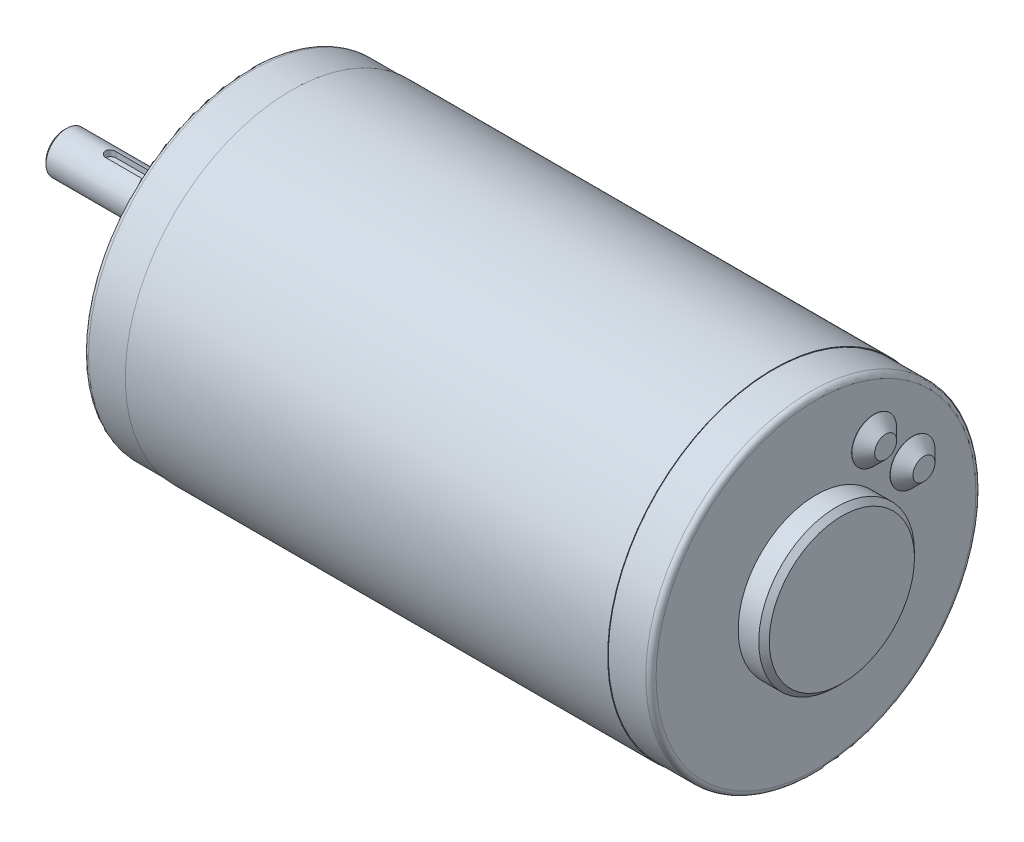
ISO-10303-21;
HEADER;
FILE_DESCRIPTION(('STEP AP214'),'2;1');
FILE_NAME('part.step','',(''),(''),'','','');
FILE_SCHEMA(('AUTOMOTIVE_DESIGN { 1 0 10303 214 1 1 1 1 }'));
ENDSEC;
DATA;
#1=APPLICATION_CONTEXT('core data for automotive mechanical design processes');
#2=APPLICATION_PROTOCOL_DEFINITION('international standard','automotive_design',2000,#1);
#3=PRODUCT_CONTEXT('',#1,'mechanical');
#4=PRODUCT('Part','Part','',(#3));
#5=PRODUCT_RELATED_PRODUCT_CATEGORY('part','',(#4));
#6=PRODUCT_DEFINITION_FORMATION('','',#4);
#7=PRODUCT_DEFINITION_CONTEXT('part definition',#1,'design');
#8=PRODUCT_DEFINITION('design','',#6,#7);
#9=PRODUCT_DEFINITION_SHAPE('','',#8);
#10=(LENGTH_UNIT() NAMED_UNIT(*) SI_UNIT(.MILLI.,.METRE.));
#11=(NAMED_UNIT(*) PLANE_ANGLE_UNIT() SI_UNIT($,.RADIAN.));
#12=(NAMED_UNIT(*) SI_UNIT($,.STERADIAN.) SOLID_ANGLE_UNIT());
#13=UNCERTAINTY_MEASURE_WITH_UNIT(LENGTH_MEASURE(1.E-05),#10,'distance_accuracy_value','');
#14=(GEOMETRIC_REPRESENTATION_CONTEXT(3) GLOBAL_UNCERTAINTY_ASSIGNED_CONTEXT((#13)) GLOBAL_UNIT_ASSIGNED_CONTEXT((#10,
#11,#12)) REPRESENTATION_CONTEXT('',''));
#15=CARTESIAN_POINT('',(0.,0.,0.));
#16=DIRECTION('',(0.,0.,1.));
#17=DIRECTION('',(1.,0.,0.));
#18=AXIS2_PLACEMENT_3D('',#15,#16,#17);
#19=CARTESIAN_POINT('',(8.2296,31.877,0.));
#20=DIRECTION('',(-1.,0.,0.));
#21=DIRECTION('',(0.,0.,1.));
#22=AXIS2_PLACEMENT_3D('',#19,#20,#21);
#23=PLANE('',#22);
#24=CARTESIAN_POINT('',(8.2296,0.,0.));
#25=DIRECTION('',(1.,0.,0.));
#26=DIRECTION('',(0.,0.,-1.));
#27=AXIS2_PLACEMENT_3D('',#24,#25,#26);
#28=CIRCLE('',#27,32.004);
#29=CARTESIAN_POINT('',(8.2296,0.,-32.004));
#30=VERTEX_POINT('',#29);
#31=EDGE_CURVE('E545',#30,#30,#28,.T.);
#32=ORIENTED_EDGE('',*,*,#31,.F.);
#33=EDGE_LOOP('',(#32));
#34=FACE_BOUND('',#33,.T.);
#35=CARTESIAN_POINT('',(8.2296,0.,0.));
#36=DIRECTION('',(-1.,0.,0.));
#37=DIRECTION('',(0.,0.,1.));
#38=AXIS2_PLACEMENT_3D('',#35,#36,#37);
#39=CIRCLE('',#38,31.877);
#40=CARTESIAN_POINT('',(8.2296,0.,31.877));
#41=VERTEX_POINT('',#40);
#42=EDGE_CURVE('E123',#41,#41,#39,.T.);
#43=ORIENTED_EDGE('',*,*,#42,.F.);
#44=EDGE_LOOP('',(#43));
#45=FACE_BOUND('',#44,.T.);
#46=ADVANCED_FACE('F49',(#34,#45),#23,.T.);
#47=CARTESIAN_POINT('',(111.8479,18.6070906828553,-11.2073596390943));
#48=DIRECTION('',(1.,0.,0.));
#49=DIRECTION('',(0.,0.,-1.));
#50=AXIS2_PLACEMENT_3D('',#47,#48,#49);
#51=PLANE('',#50);
#52=CARTESIAN_POINT('',(111.84789999993,18.6070906828553,-11.2073596390943));
#53=DIRECTION('',(-1.,0.,0.));
#54=DIRECTION('',(0.,-1.,0.));
#55=AXIS2_PLACEMENT_3D('',#52,#53,#54);
#56=CIRCLE('',#55,2.11800000003146);
#57=CARTESIAN_POINT('',(111.84789999993,16.4890906828238,-11.2073596390943));
#58=VERTEX_POINT('',#57);
#59=EDGE_CURVE('E677',#58,#58,#56,.T.);
#60=ORIENTED_EDGE('',*,*,#59,.F.);
#61=EDGE_LOOP('',(#60));
#62=FACE_BOUND('',#61,.T.);
#63=ADVANCED_FACE('F182',(#62),#51,.T.);
#64=CARTESIAN_POINT('',(114.6,15.0368,0.));
#65=DIRECTION('',(1.,0.,0.));
#66=DIRECTION('',(0.,0.,-1.));
#67=AXIS2_PLACEMENT_3D('',#64,#65,#66);
#68=PLANE('',#67);
#69=CARTESIAN_POINT('',(114.6,0.,0.));
#70=DIRECTION('',(-1.,0.,0.));
#71=DIRECTION('',(0.,-1.,0.));
#72=AXIS2_PLACEMENT_3D('',#69,#70,#71);
#73=CIRCLE('',#72,14.0208);
#74=CARTESIAN_POINT('',(114.6,-14.0208,0.));
#75=VERTEX_POINT('',#74);
#76=EDGE_CURVE('E667',#75,#75,#73,.T.);
#77=ORIENTED_EDGE('',*,*,#76,.F.);
#78=EDGE_LOOP('',(#77));
#79=FACE_BOUND('',#78,.T.);
#80=ADVANCED_FACE('F190',(#79),#68,.T.);
#81=CARTESIAN_POINT('',(111.8479,11.2073596390943,-18.6070906828553));
#82=DIRECTION('',(1.,0.,0.));
#83=DIRECTION('',(0.,0.,-1.));
#84=AXIS2_PLACEMENT_3D('',#81,#82,#83);
#85=PLANE('',#84);
#86=CARTESIAN_POINT('',(111.84789999993,11.2073596390943,-18.6070906828553));
#87=DIRECTION('',(-1.,0.,0.));
#88=DIRECTION('',(0.,0.,1.));
#89=AXIS2_PLACEMENT_3D('',#86,#87,#88);
#90=CIRCLE('',#89,2.1180000000021);
#91=CARTESIAN_POINT('',(111.84789999993,11.2073596390943,-16.4890906828532));
#92=VERTEX_POINT('',#91);
#93=EDGE_CURVE('E657',#92,#92,#90,.T.);
#94=ORIENTED_EDGE('',*,*,#93,.F.);
#95=EDGE_LOOP('',(#94));
#96=FACE_BOUND('',#95,.T.);
#97=ADVANCED_FACE('F323',(#96),#85,.T.);
#98=CARTESIAN_POINT('',(109.647900000027,18.6070906828553,-11.2073596390943));
#99=DIRECTION('',(-1.,0.,0.));
#100=DIRECTION('',(0.,-1.,0.));
#101=AXIS2_PLACEMENT_3D('',#98,#99,#100);
#102=CONICAL_SURFACE('',#101,4.31799999987712,0.785398163384529);
#103=CARTESIAN_POINT('',(109.6479,18.6070906828553,-11.2073596390943));
#104=DIRECTION('',(-1.,0.,0.));
#105=DIRECTION('',(0.,0.,1.));
#106=AXIS2_PLACEMENT_3D('',#103,#104,#105);
#107=CIRCLE('',#106,4.318);
#108=CARTESIAN_POINT('',(109.6479,18.6070906828553,-6.88935963909434));
#109=VERTEX_POINT('',#108);
#110=EDGE_CURVE('E637',#109,#109,#107,.T.);
#111=ORIENTED_EDGE('',*,*,#110,.F.);
#112=EDGE_LOOP('',(#111));
#113=FACE_BOUND('',#112,.T.);
#114=ORIENTED_EDGE('',*,*,#59,.T.);
#115=EDGE_LOOP('',(#114));
#116=FACE_BOUND('',#115,.T.);
#117=ADVANCED_FACE('F314',(#113,#116),#102,.T.);
#118=CARTESIAN_POINT('',(113.584,0.,0.));
#119=DIRECTION('',(-1.,0.,0.));
#120=DIRECTION('',(0.,-1.,0.));
#121=AXIS2_PLACEMENT_3D('',#118,#119,#120);
#122=CONICAL_SURFACE('',#121,15.0368,0.785398163397441);
#123=ORIENTED_EDGE('',*,*,#76,.T.);
#124=EDGE_LOOP('',(#123));
#125=FACE_BOUND('',#124,.T.);
#126=CARTESIAN_POINT('',(113.584,0.,0.));
#127=DIRECTION('',(1.,0.,0.));
#128=DIRECTION('',(0.,0.,-1.));
#129=AXIS2_PLACEMENT_3D('',#126,#127,#128);
#130=CIRCLE('',#129,15.0368);
#131=CARTESIAN_POINT('',(113.584,0.,-15.0368));
#132=VERTEX_POINT('',#131);
#133=EDGE_CURVE('E628',#132,#132,#130,.F.);
#134=ORIENTED_EDGE('',*,*,#133,.F.);
#135=EDGE_LOOP('',(#134));
#136=FACE_BOUND('',#135,.T.);
#137=ADVANCED_FACE('F305',(#125,#136),#122,.T.);
#138=CARTESIAN_POINT('',(109.647900000084,11.2073596390943,-18.6070906828553));
#139=DIRECTION('',(-1.,0.,0.));
#140=DIRECTION('',(0.,0.,1.));
#141=AXIS2_PLACEMENT_3D('',#138,#139,#140);
#142=CONICAL_SURFACE('',#141,4.31799999990461,0.785398163410367);
#143=CARTESIAN_POINT('',(109.6479,11.2073596390943,-18.6070906828553));
#144=DIRECTION('',(-1.,0.,0.));
#145=DIRECTION('',(0.,0.,1.));
#146=AXIS2_PLACEMENT_3D('',#143,#144,#145);
#147=CIRCLE('',#146,4.318);
#148=CARTESIAN_POINT('',(109.6479,11.2073596390943,-14.2890906828553));
#149=VERTEX_POINT('',#148);
#150=EDGE_CURVE('E618',#149,#149,#147,.T.);
#151=ORIENTED_EDGE('',*,*,#150,.F.);
#152=EDGE_LOOP('',(#151));
#153=FACE_BOUND('',#152,.T.);
#154=ORIENTED_EDGE('',*,*,#93,.T.);
#155=EDGE_LOOP('',(#154));
#156=FACE_BOUND('',#155,.T.);
#157=ADVANCED_FACE('F297',(#153,#156),#142,.T.);
#158=CARTESIAN_POINT('',(111.8479,18.6070906828553,-11.2073596390943));
#159=DIRECTION('',(-1.,0.,0.));
#160=DIRECTION('',(0.,0.,1.));
#161=AXIS2_PLACEMENT_3D('',#158,#159,#160);
#162=CYLINDRICAL_SURFACE('',#161,4.318);
#163=CARTESIAN_POINT('',(109.6,18.6070906828553,-11.2073596390943));
#164=DIRECTION('',(-1.,0.,0.));
#165=DIRECTION('',(0.,0.,1.));
#166=AXIS2_PLACEMENT_3D('',#163,#164,#165);
#167=CIRCLE('',#166,4.318);
#168=CARTESIAN_POINT('',(109.6,18.6070906828553,-6.88935963909434));
#169=VERTEX_POINT('',#168);
#170=EDGE_CURVE('E608',#169,#169,#167,.T.);
#171=ORIENTED_EDGE('',*,*,#170,.F.);
#172=EDGE_LOOP('',(#171));
#173=FACE_BOUND('',#172,.T.);
#174=ORIENTED_EDGE('',*,*,#110,.T.);
#175=EDGE_LOOP('',(#174));
#176=FACE_BOUND('',#175,.T.);
#177=ADVANCED_FACE('F289',(#173,#176),#162,.T.);
#178=CARTESIAN_POINT('',(0.,0.,0.));
#179=DIRECTION('',(1.,0.,0.));
#180=DIRECTION('',(0.,0.,-1.));
#181=AXIS2_PLACEMENT_3D('',#178,#179,#180);
#182=CYLINDRICAL_SURFACE('',#181,15.0368);
#183=CARTESIAN_POINT('',(109.6,0.,0.));
#184=DIRECTION('',(1.,0.,0.));
#185=DIRECTION('',(0.,0.,-1.));
#186=AXIS2_PLACEMENT_3D('',#183,#184,#185);
#187=CIRCLE('',#186,15.0368);
#188=CARTESIAN_POINT('',(109.6,0.,-15.0368));
#189=VERTEX_POINT('',#188);
#190=EDGE_CURVE('E598',#189,#189,#187,.F.);
#191=ORIENTED_EDGE('',*,*,#190,.F.);
#192=EDGE_LOOP('',(#191));
#193=FACE_BOUND('',#192,.T.);
#194=ORIENTED_EDGE('',*,*,#133,.T.);
#195=EDGE_LOOP('',(#194));
#196=FACE_BOUND('',#195,.T.);
#197=ADVANCED_FACE('F281',(#193,#196),#182,.T.);
#198=CARTESIAN_POINT('',(111.8479,11.2073596390943,-18.6070906828553));
#199=DIRECTION('',(-1.,0.,0.));
#200=DIRECTION('',(0.,0.,1.));
#201=AXIS2_PLACEMENT_3D('',#198,#199,#200);
#202=CYLINDRICAL_SURFACE('',#201,4.318);
#203=CARTESIAN_POINT('',(109.6,11.2073596390943,-18.6070906828553));
#204=DIRECTION('',(-1.,0.,0.));
#205=DIRECTION('',(0.,0.,1.));
#206=AXIS2_PLACEMENT_3D('',#203,#204,#205);
#207=CIRCLE('',#206,4.318);
#208=CARTESIAN_POINT('',(109.6,11.2073596390943,-14.2890906828553));
#209=VERTEX_POINT('',#208);
#210=EDGE_CURVE('E589',#209,#209,#207,.T.);
#211=ORIENTED_EDGE('',*,*,#210,.F.);
#212=EDGE_LOOP('',(#211));
#213=FACE_BOUND('',#212,.T.);
#214=ORIENTED_EDGE('',*,*,#150,.T.);
#215=EDGE_LOOP('',(#214));
#216=FACE_BOUND('',#215,.T.);
#217=ADVANCED_FACE('F272',(#213,#216),#202,.T.);
#218=CARTESIAN_POINT('',(109.6,31.877,0.));
#219=DIRECTION('',(1.,0.,0.));
#220=DIRECTION('',(0.,0.,-1.));
#221=AXIS2_PLACEMENT_3D('',#218,#219,#220);
#222=PLANE('',#221);
#223=ORIENTED_EDGE('',*,*,#210,.T.);
#224=EDGE_LOOP('',(#223));
#225=FACE_BOUND('',#224,.T.);
#226=ORIENTED_EDGE('',*,*,#190,.T.);
#227=EDGE_LOOP('',(#226));
#228=FACE_BOUND('',#227,.T.);
#229=CARTESIAN_POINT('',(109.6,0.,0.));
#230=DIRECTION('',(-1.,0.,0.));
#231=DIRECTION('',(0.,0.,1.));
#232=AXIS2_PLACEMENT_3D('',#229,#230,#231);
#233=CIRCLE('',#232,30.877);
#234=CARTESIAN_POINT('',(109.6,0.,30.877));
#235=VERTEX_POINT('',#234);
#236=CARTESIAN_POINT('',(109.6,0.,-30.877));
#237=VERTEX_POINT('',#236);
#238=EDGE_CURVE('E65',#235,#237,#233,.T.);
#239=ORIENTED_EDGE('',*,*,#238,.F.);
#240=CARTESIAN_POINT('',(109.6,0.,0.));
#241=DIRECTION('',(-1.,0.,0.));
#242=DIRECTION('',(0.,0.,-1.));
#243=AXIS2_PLACEMENT_3D('',#240,#241,#242);
#244=CIRCLE('',#243,30.877);
#245=EDGE_CURVE('E574',#237,#235,#244,.T.);
#246=ORIENTED_EDGE('',*,*,#245,.F.);
#247=EDGE_LOOP('',(#239,#246));
#248=FACE_BOUND('',#247,.T.);
#249=ORIENTED_EDGE('',*,*,#170,.T.);
#250=EDGE_LOOP('',(#249));
#251=FACE_BOUND('',#250,.T.);
#252=ADVANCED_FACE('F138',(#225,#228,#248,#251),#222,.T.);
#253=CARTESIAN_POINT('',(108.6,0.,0.));
#254=DIRECTION('',(1.,0.,0.));
#255=DIRECTION('',(0.,0.,-1.));
#256=AXIS2_PLACEMENT_3D('',#253,#254,#255);
#257=TOROIDAL_SURFACE('',#256,30.877,1.);
#258=CARTESIAN_POINT('',(108.6,0.,0.));
#259=DIRECTION('',(1.,0.,0.));
#260=DIRECTION('',(0.,0.,-1.));
#261=AXIS2_PLACEMENT_3D('',#258,#259,#260);
#262=CIRCLE('',#261,31.877);
#263=CARTESIAN_POINT('',(108.6,0.,-31.877));
#264=VERTEX_POINT('',#263);
#265=EDGE_CURVE('E129',#264,#264,#262,.F.);
#266=ORIENTED_EDGE('',*,*,#265,.F.);
#267=EDGE_LOOP('',(#266));
#268=FACE_BOUND('',#267,.T.);
#269=ORIENTED_EDGE('',*,*,#245,.T.);
#270=ORIENTED_EDGE('',*,*,#238,.T.);
#271=EDGE_LOOP('',(#269,#270));
#272=FACE_BOUND('',#271,.T.);
#273=ADVANCED_FACE('F132',(#268,#272),#257,.T.);
#274=CARTESIAN_POINT('',(0.,0.,0.));
#275=DIRECTION('',(1.,0.,0.));
#276=DIRECTION('',(0.,0.,-1.));
#277=AXIS2_PLACEMENT_3D('',#274,#275,#276);
#278=CYLINDRICAL_SURFACE('',#277,31.877);
#279=CARTESIAN_POINT('',(101.3704,0.,0.));
#280=DIRECTION('',(1.,0.,0.));
#281=DIRECTION('',(0.,0.,-1.));
#282=AXIS2_PLACEMENT_3D('',#279,#280,#281);
#283=CIRCLE('',#282,31.877);
#284=CARTESIAN_POINT('',(101.3704,0.,-31.877));
#285=VERTEX_POINT('',#284);
#286=EDGE_CURVE('E555',#285,#285,#283,.F.);
#287=ORIENTED_EDGE('',*,*,#286,.F.);
#288=EDGE_LOOP('',(#287));
#289=FACE_BOUND('',#288,.T.);
#290=ORIENTED_EDGE('',*,*,#265,.T.);
#291=EDGE_LOOP('',(#290));
#292=FACE_BOUND('',#291,.T.);
#293=ADVANCED_FACE('F137',(#289,#292),#278,.T.);
#294=CARTESIAN_POINT('',(101.3704,32.004,0.));
#295=DIRECTION('',(1.,0.,0.));
#296=DIRECTION('',(0.,0.,-1.));
#297=AXIS2_PLACEMENT_3D('',#294,#295,#296);
#298=PLANE('',#297);
#299=ORIENTED_EDGE('',*,*,#286,.T.);
#300=EDGE_LOOP('',(#299));
#301=FACE_BOUND('',#300,.T.);
#302=CARTESIAN_POINT('',(101.3704,0.,0.));
#303=DIRECTION('',(1.,0.,0.));
#304=DIRECTION('',(0.,0.,-1.));
#305=AXIS2_PLACEMENT_3D('',#302,#303,#304);
#306=CIRCLE('',#305,32.004);
#307=CARTESIAN_POINT('',(101.3704,0.,-32.004));
#308=VERTEX_POINT('',#307);
#309=EDGE_CURVE('E161',#308,#308,#306,.F.);
#310=ORIENTED_EDGE('',*,*,#309,.F.);
#311=EDGE_LOOP('',(#310));
#312=FACE_BOUND('',#311,.T.);
#313=ADVANCED_FACE('F197',(#301,#312),#298,.T.);
#314=CARTESIAN_POINT('',(0.,0.,0.));
#315=DIRECTION('',(1.,0.,0.));
#316=DIRECTION('',(0.,0.,-1.));
#317=AXIS2_PLACEMENT_3D('',#314,#315,#316);
#318=CYLINDRICAL_SURFACE('',#317,32.004);
#319=ORIENTED_EDGE('',*,*,#309,.T.);
#320=EDGE_LOOP('',(#319));
#321=FACE_BOUND('',#320,.T.);
#322=ORIENTED_EDGE('',*,*,#31,.T.);
#323=EDGE_LOOP('',(#322));
#324=FACE_BOUND('',#323,.T.);
#325=ADVANCED_FACE('F184',(#321,#324),#318,.T.);
#326=CARTESIAN_POINT('',(0.,0.,0.));
#327=DIRECTION('',(-1.,0.,0.));
#328=DIRECTION('',(0.,0.,1.));
#329=AXIS2_PLACEMENT_3D('',#326,#327,#328);
#330=PLANE('',#329);
#331=CARTESIAN_POINT('',(0.,-25.4,0.));
#332=DIRECTION('',(-1.,0.,0.));
#333=DIRECTION('',(0.,0.,1.));
#334=AXIS2_PLACEMENT_3D('',#331,#332,#333);
#335=CIRCLE('',#334,2.01929999999999);
#336=CARTESIAN_POINT('',(0.,-25.4,2.01929999999999));
#337=VERTEX_POINT('',#336);
#338=EDGE_CURVE('E113',#337,#337,#335,.T.);
#339=ORIENTED_EDGE('',*,*,#338,.F.);
#340=EDGE_LOOP('',(#339));
#341=FACE_BOUND('',#340,.T.);
#342=CARTESIAN_POINT('',(0.,25.4,0.));
#343=DIRECTION('',(-1.,0.,0.));
#344=DIRECTION('',(0.,0.,1.));
#345=AXIS2_PLACEMENT_3D('',#342,#343,#344);
#346=CIRCLE('',#345,2.01929999999999);
#347=CARTESIAN_POINT('',(0.,25.4,2.01929999999999));
#348=VERTEX_POINT('',#347);
#349=EDGE_CURVE('E112',#348,#348,#346,.T.);
#350=ORIENTED_EDGE('',*,*,#349,.F.);
#351=EDGE_LOOP('',(#350));
#352=FACE_BOUND('',#351,.T.);
#353=CARTESIAN_POINT('',(0.,0.,0.));
#354=DIRECTION('',(-1.,0.,0.));
#355=DIRECTION('',(0.,0.,1.));
#356=AXIS2_PLACEMENT_3D('',#353,#354,#355);
#357=CIRCLE('',#356,30.877);
#358=CARTESIAN_POINT('',(0.,0.,30.877));
#359=VERTEX_POINT('',#358);
#360=EDGE_CURVE('E58',#359,#359,#357,.T.);
#361=ORIENTED_EDGE('',*,*,#360,.T.);
#362=EDGE_LOOP('',(#361));
#363=FACE_BOUND('',#362,.T.);
#364=CARTESIAN_POINT('',(0.,0.,0.));
#365=DIRECTION('',(-1.,0.,0.));
#366=DIRECTION('',(0.,0.,1.));
#367=AXIS2_PLACEMENT_3D('',#364,#365,#366);
#368=CIRCLE('',#367,9.525);
#369=CARTESIAN_POINT('',(0.,0.,9.525));
#370=VERTEX_POINT('',#369);
#371=EDGE_CURVE('E154',#370,#370,#368,.F.);
#372=ORIENTED_EDGE('',*,*,#371,.T.);
#373=EDGE_LOOP('',(#372));
#374=FACE_BOUND('',#373,.T.);
#375=ADVANCED_FACE('F165',(#341,#352,#363,#374),#330,.T.);
#376=CARTESIAN_POINT('',(0.,0.,0.));
#377=DIRECTION('',(1.,0.,0.));
#378=DIRECTION('',(0.,0.,-1.));
#379=AXIS2_PLACEMENT_3D('',#376,#377,#378);
#380=CYLINDRICAL_SURFACE('',#379,31.877);
#381=CARTESIAN_POINT('',(0.999999999999998,0.,0.));
#382=DIRECTION('',(-1.,0.,0.));
#383=DIRECTION('',(0.,0.,1.));
#384=AXIS2_PLACEMENT_3D('',#381,#382,#383);
#385=CIRCLE('',#384,31.877);
#386=CARTESIAN_POINT('',(0.999999999999998,0.,31.877));
#387=VERTEX_POINT('',#386);
#388=EDGE_CURVE('E13',#387,#387,#385,.F.);
#389=ORIENTED_EDGE('',*,*,#388,.T.);
#390=EDGE_LOOP('',(#389));
#391=FACE_BOUND('',#390,.T.);
#392=ORIENTED_EDGE('',*,*,#42,.T.);
#393=EDGE_LOOP('',(#392));
#394=FACE_BOUND('',#393,.T.);
#395=ADVANCED_FACE('F204',(#391,#394),#380,.T.);
#396=CARTESIAN_POINT('',(-27.6,2.79999999999999,-1.));
#397=DIRECTION('',(0.,-1.,0.));
#398=DIRECTION('',(0.,0.,-1.));
#399=AXIS2_PLACEMENT_3D('',#396,#397,#398);
#400=PLANE('',#399);
#401=CARTESIAN_POINT('',(-7.1,2.79999999999999,0.));
#402=DIRECTION('',(0.,1.,0.));
#403=DIRECTION('',(0.,0.,1.));
#404=AXIS2_PLACEMENT_3D('',#401,#402,#403);
#405=CIRCLE('',#404,1.);
#406=CARTESIAN_POINT('',(-7.1,2.79999999999999,1.));
#407=VERTEX_POINT('',#406);
#408=CARTESIAN_POINT('',(-7.1,2.79999999999999,-1.));
#409=VERTEX_POINT('',#408);
#410=EDGE_CURVE('E804',#407,#409,#405,.T.);
#411=ORIENTED_EDGE('',*,*,#410,.T.);
#412=DIRECTION('',(1.,0.,0.));
#413=VECTOR('',#412,1.);
#414=CARTESIAN_POINT('',(-27.6,2.79999999999999,-1.));
#415=LINE('',#414,#413);
#416=CARTESIAN_POINT('',(-26.6,2.79999999999999,-1.));
#417=VERTEX_POINT('',#416);
#418=EDGE_CURVE('E95',#417,#409,#415,.T.);
#419=ORIENTED_EDGE('',*,*,#418,.F.);
#420=CARTESIAN_POINT('',(-26.6,2.79999999999999,0.));
#421=DIRECTION('',(0.,-1.,0.));
#422=DIRECTION('',(0.,0.,-1.));
#423=AXIS2_PLACEMENT_3D('',#420,#421,#422);
#424=CIRCLE('',#423,1.);
#425=CARTESIAN_POINT('',(-26.6,2.79999999999999,1.));
#426=VERTEX_POINT('',#425);
#427=EDGE_CURVE('E126',#417,#426,#424,.F.);
#428=ORIENTED_EDGE('',*,*,#427,.T.);
#429=DIRECTION('',(1.,0.,0.));
#430=VECTOR('',#429,1.);
#431=CARTESIAN_POINT('',(-27.6,2.79999999999999,1.));
#432=LINE('',#431,#430);
#433=EDGE_CURVE('E776',#426,#407,#432,.T.);
#434=ORIENTED_EDGE('',*,*,#433,.T.);
#435=EDGE_LOOP('',(#411,#419,#428,#434));
#436=FACE_BOUND('',#435,.T.);
#437=ADVANCED_FACE('F213',(#436),#400,.F.);
#438=CARTESIAN_POINT('',(-35.6,0.,0.));
#439=DIRECTION('',(-1.,0.,0.));
#440=DIRECTION('',(0.,0.,1.));
#441=AXIS2_PLACEMENT_3D('',#438,#439,#440);
#442=PLANE('',#441);
#443=CARTESIAN_POINT('',(-35.6000000000449,0.,0.));
#444=DIRECTION('',(1.,0.,0.));
#445=DIRECTION('',(0.,0.,-1.));
#446=AXIS2_PLACEMENT_3D('',#443,#444,#445);
#447=CIRCLE('',#446,3.49999999997408);
#448=CARTESIAN_POINT('',(-35.6000000000449,0.,-3.49999999997408));
#449=VERTEX_POINT('',#448);
#450=EDGE_CURVE('E757',#449,#449,#447,.T.);
#451=ORIENTED_EDGE('',*,*,#450,.F.);
#452=EDGE_LOOP('',(#451));
#453=FACE_BOUND('',#452,.T.);
#454=ADVANCED_FACE('F373',(#453),#442,.T.);
#455=CARTESIAN_POINT('',(-27.6,2.79999999999999,-1.));
#456=DIRECTION('',(0.,0.,1.));
#457=DIRECTION('',(1.,0.,0.));
#458=AXIS2_PLACEMENT_3D('',#455,#456,#457);
#459=PLANE('',#458);
#460=DIRECTION('',(1.,0.,0.));
#461=VECTOR('',#460,1.);
#462=CARTESIAN_POINT('',(0.,3.87298334620741,-1.));
#463=LINE('',#462,#461);
#464=CARTESIAN_POINT('',(-26.6,3.87298334620741,-1.));
#465=VERTEX_POINT('',#464);
#466=CARTESIAN_POINT('',(-7.1,3.87298334620741,-1.));
#467=VERTEX_POINT('',#466);
#468=EDGE_CURVE('E737',#465,#467,#463,.T.);
#469=ORIENTED_EDGE('',*,*,#468,.F.);
#470=DIRECTION('',(0.,1.,0.));
#471=VECTOR('',#470,1.);
#472=CARTESIAN_POINT('',(-26.6,2.79999999999999,-1.));
#473=LINE('',#472,#471);
#474=EDGE_CURVE('E813',#465,#417,#473,.F.);
#475=ORIENTED_EDGE('',*,*,#474,.T.);
#476=ORIENTED_EDGE('',*,*,#418,.T.);
#477=DIRECTION('',(0.,1.,0.));
#478=VECTOR('',#477,1.);
#479=CARTESIAN_POINT('',(-7.1,2.79999999999999,-1.));
#480=LINE('',#479,#478);
#481=EDGE_CURVE('E795',#409,#467,#480,.T.);
#482=ORIENTED_EDGE('',*,*,#481,.T.);
#483=EDGE_LOOP('',(#469,#475,#476,#482));
#484=FACE_BOUND('',#483,.T.);
#485=ADVANCED_FACE('F369',(#484),#459,.T.);
#486=CARTESIAN_POINT('',(-26.6,3.87298334620741,0.));
#487=DIRECTION('',(0.,-1.,0.));
#488=DIRECTION('',(0.,0.,-1.));
#489=AXIS2_PLACEMENT_3D('',#486,#487,#488);
#490=CYLINDRICAL_SURFACE('',#489,1.);
#491=CARTESIAN_POINT('',(-26.6,3.87298334620741,1.));
#492=CARTESIAN_POINT('',(-26.6276629851065,3.87298148580177,1.00000033749611));
#493=CARTESIAN_POINT('',(-26.6553122630182,3.8732800994947,0.998851407375366));
#494=CARTESIAN_POINT('',(-26.7104040353036,3.87445904774558,0.994271295395754));
#495=CARTESIAN_POINT('',(-26.7378465636871,3.87533928441687,0.990840497572679));
#496=CARTESIAN_POINT('',(-26.8194531732088,3.87881710972053,0.977175239382526));
#497=CARTESIAN_POINT('',(-26.8730564684822,3.88225203148808,0.963567695172493));
#498=CARTESIAN_POINT('',(-26.977124673782,3.89095422588002,0.927798076247996));
#499=CARTESIAN_POINT('',(-27.0275898782129,3.89622132630929,0.905636805423835));
#500=CARTESIAN_POINT('',(-27.1241114486473,3.90799134471939,0.853415378025864));
#501=CARTESIAN_POINT('',(-27.170166627891,3.91449459395647,0.823353103356932));
#502=CARTESIAN_POINT('',(-27.2575438819061,3.92816262398025,0.755484471828069));
#503=CARTESIAN_POINT('',(-27.2987548862455,3.93533791028915,0.717537268783975));
#504=CARTESIAN_POINT('',(-27.3743020894827,3.94945104396193,0.635275780516229));
#505=CARTESIAN_POINT('',(-27.4086371894679,3.95638885322537,0.59096047947883));
#506=CARTESIAN_POINT('',(-27.4699110016186,3.96936182283248,0.496456899401689));
#507=CARTESIAN_POINT('',(-27.496739895984,3.9753830468173,0.446195340334472));
#508=CARTESIAN_POINT('',(-27.5415247341967,3.98572346250588,0.341702590842916));
#509=CARTESIAN_POINT('',(-27.5594824242998,3.990042989147,0.287472184083007));
#510=CARTESIAN_POINT('',(-27.5856589927774,3.99641900005128,0.177744108525158));
#511=CARTESIAN_POINT('',(-27.5940676724228,3.998519529013,0.122294322002856));
#512=CARTESIAN_POINT('',(-27.6015033715433,4.00037438150815,0.0107327756816781));
#513=CARTESIAN_POINT('',(-27.6005315701923,4.00012899993444,-0.0453789000287067));
#514=CARTESIAN_POINT('',(-27.5893700363146,3.99735237365735,-0.155352492972096));
#515=CARTESIAN_POINT('',(-27.5793853834005,3.9948719867736,-0.209236701739855));
#516=CARTESIAN_POINT('',(-27.5508113208173,3.98796330636495,-0.31453871108434));
#517=CARTESIAN_POINT('',(-27.5322215304314,3.98353492665556,-0.365956402423988));
#518=CARTESIAN_POINT('',(-27.4867987193294,3.97314997761798,-0.46540728602454));
#519=CARTESIAN_POINT('',(-27.4598926057672,3.96717993827555,-0.513405629602248));
#520=CARTESIAN_POINT('',(-27.3986568701665,3.95435945541919,-0.604276631230015));
#521=CARTESIAN_POINT('',(-27.3643261297468,3.94750887933198,-0.64714851556229));
#522=CARTESIAN_POINT('',(-27.2881210879187,3.93345566022865,-0.727769389708492));
#523=CARTESIAN_POINT('',(-27.2460683634602,3.92624850477685,-0.765349103054128));
#524=CARTESIAN_POINT('',(-27.1561701330723,3.91246168284006,-0.832969575186237));
#525=CARTESIAN_POINT('',(-27.1083230467164,3.90588218842993,-0.863008270245062));
#526=CARTESIAN_POINT('',(-27.0078544021762,3.89407813586325,-0.914804709285961));
#527=CARTESIAN_POINT('',(-26.9552085351039,3.88886106009136,-0.936517017887269));
#528=CARTESIAN_POINT('',(-26.8468830715817,3.88047058807054,-0.970702351849828));
#529=CARTESIAN_POINT('',(-26.7912081448502,3.87729413761435,-0.983189189212131));
#530=CARTESIAN_POINT('',(-26.7125426192411,3.87455290681524,-0.993904635150938));
#531=CARTESIAN_POINT('',(-26.6900802967868,3.87396523110859,-0.996190790966708));
#532=CARTESIAN_POINT('',(-26.6450822100907,3.87318062488974,-0.999236757697394));
#533=CARTESIAN_POINT('',(-26.6225466240447,3.87298306219461,-0.999999038096045));
#534=CARTESIAN_POINT('',(-26.6,3.87298334620741,-1.));
#535=B_SPLINE_CURVE_WITH_KNOTS('',3,(#491,#492,#493,#494,#495,#496,#497,#498,#499,#500,#501,
#502,#503,#504,#505,#506,#507,#508,#509,#510,#511,#512,#513,#514,#515,#516,#517,#518,#519,#520,
#521,#522,#523,#524,#525,#526,#527,#528,#529,#530,#531,#532,#533,#534),.UNSPECIFIED.,.F.,.F.,(4,
2,2,2,2,2,2,2,2,2,2,2,2,2,2,2,2,2,2,2,2,4),(0.,0.0829365303397727,0.165859106084653,
0.331229963080318,0.496585282091499,0.661984974726751,0.830641897427976,0.999325753539196,
1.17036187098235,1.34136430732425,1.50890481515325,1.67642426256639,1.84022545479276,
2.00403389475838,2.16932509450376,2.33464120964329,2.50441429534542,2.67423379180967,
2.84496720161068,3.01544447539986,3.08315848722649,3.15076267731671),.UNSPECIFIED.);
#536=CARTESIAN_POINT('',(-26.6,3.87298334620741,1.));
#537=VERTEX_POINT('',#536);
#538=EDGE_CURVE('E747',#537,#465,#535,.T.);
#539=ORIENTED_EDGE('',*,*,#538,.F.);
#540=DIRECTION('',(0.,1.,0.));
#541=VECTOR('',#540,1.);
#542=CARTESIAN_POINT('',(-26.6,2.79999999999999,1.));
#543=LINE('',#542,#541);
#544=EDGE_CURVE('E785',#537,#426,#543,.F.);
#545=ORIENTED_EDGE('',*,*,#544,.T.);
#546=ORIENTED_EDGE('',*,*,#427,.F.);
#547=ORIENTED_EDGE('',*,*,#474,.F.);
#548=EDGE_LOOP('',(#539,#545,#546,#547));
#549=FACE_BOUND('',#548,.T.);
#550=ADVANCED_FACE('F372',(#549),#490,.F.);
#551=CARTESIAN_POINT('',(-27.6,2.79999999999999,1.));
#552=DIRECTION('',(0.,0.,1.));
#553=DIRECTION('',(1.,0.,0.));
#554=AXIS2_PLACEMENT_3D('',#551,#552,#553);
#555=PLANE('',#554);
#556=DIRECTION('',(0.,1.,0.));
#557=VECTOR('',#556,1.);
#558=CARTESIAN_POINT('',(-7.1,2.79999999999999,1.));
#559=LINE('',#558,#557);
#560=CARTESIAN_POINT('',(-7.1,3.87298334620741,1.));
#561=VERTEX_POINT('',#560);
#562=EDGE_CURVE('E767',#407,#561,#559,.T.);
#563=ORIENTED_EDGE('',*,*,#562,.F.);
#564=ORIENTED_EDGE('',*,*,#433,.F.);
#565=ORIENTED_EDGE('',*,*,#544,.F.);
#566=DIRECTION('',(1.,0.,0.));
#567=VECTOR('',#566,1.);
#568=CARTESIAN_POINT('',(0.,3.87298334620741,1.));
#569=LINE('',#568,#567);
#570=EDGE_CURVE('E717',#561,#537,#569,.F.);
#571=ORIENTED_EDGE('',*,*,#570,.F.);
#572=EDGE_LOOP('',(#563,#564,#565,#571));
#573=FACE_BOUND('',#572,.T.);
#574=ADVANCED_FACE('F422',(#573),#555,.F.);
#575=CARTESIAN_POINT('',(-7.1,2.79999999999999,0.));
#576=DIRECTION('',(0.,1.,0.));
#577=DIRECTION('',(0.,0.,1.));
#578=AXIS2_PLACEMENT_3D('',#575,#576,#577);
#579=CYLINDRICAL_SURFACE('',#578,1.);
#580=ORIENTED_EDGE('',*,*,#410,.F.);
#581=ORIENTED_EDGE('',*,*,#562,.T.);
#582=CARTESIAN_POINT('',(-7.1,3.87298334620741,-1.));
#583=CARTESIAN_POINT('',(-7.07233701489346,3.87298148580177,-1.00000033749611));
#584=CARTESIAN_POINT('',(-7.04468773698177,3.8732800994947,-0.998851407375366));
#585=CARTESIAN_POINT('',(-6.98959596469644,3.87445904774558,-0.994271295395754));
#586=CARTESIAN_POINT('',(-6.96215343631291,3.87533928441687,-0.990840497572679));
#587=CARTESIAN_POINT('',(-6.88054682679116,3.87881710972053,-0.977175239382526));
#588=CARTESIAN_POINT('',(-6.82694353151779,3.88225203148808,-0.963567695172493));
#589=CARTESIAN_POINT('',(-6.72287532621804,3.89095422588002,-0.927798076247997));
#590=CARTESIAN_POINT('',(-6.67241012178714,3.89622132630929,-0.905636805423836));
#591=CARTESIAN_POINT('',(-6.57588855135267,3.90799134471939,-0.853415378025865));
#592=CARTESIAN_POINT('',(-6.52983337210904,3.91449459395647,-0.823353103356933));
#593=CARTESIAN_POINT('',(-6.4424561180939,3.92816262398025,-0.755484471828069));
#594=CARTESIAN_POINT('',(-6.40124511375448,3.93533791028915,-0.717537268783976));
#595=CARTESIAN_POINT('',(-6.32569791051729,3.94945104396193,-0.63527578051623));
#596=CARTESIAN_POINT('',(-6.29136281053206,3.95638885322537,-0.590960479478831));
#597=CARTESIAN_POINT('',(-6.23008899838136,3.96936182283248,-0.496456899401691));
#598=CARTESIAN_POINT('',(-6.20326010401603,3.9753830468173,-0.446195340334474));
#599=CARTESIAN_POINT('',(-6.1584752658033,3.98572346250588,-0.341702590842919));
#600=CARTESIAN_POINT('',(-6.14051757570017,3.990042989147,-0.28747218408301));
#601=CARTESIAN_POINT('',(-6.11434100722257,3.99641900005128,-0.17774410852516));
#602=CARTESIAN_POINT('',(-6.10593232757718,3.998519529013,-0.122294322002858));
#603=CARTESIAN_POINT('',(-6.09849662845671,4.00037438150815,-0.0107327756816796));
#604=CARTESIAN_POINT('',(-6.09946842980766,4.00012899993444,0.0453789000287057));
#605=CARTESIAN_POINT('',(-6.11062996368545,3.99735237365735,0.155352492972096));
#606=CARTESIAN_POINT('',(-6.12061461659948,3.9948719867736,0.209236701739855));
#607=CARTESIAN_POINT('',(-6.14918867918275,3.98796330636495,0.31453871108434));
#608=CARTESIAN_POINT('',(-6.16777846956858,3.98353492665556,0.365956402423988));
#609=CARTESIAN_POINT('',(-6.21320128067065,3.97314997761798,0.465407286024539));
#610=CARTESIAN_POINT('',(-6.24010739423284,3.96717993827555,0.513405629602248));
#611=CARTESIAN_POINT('',(-6.30134312983347,3.95435945541919,0.604276631230014));
#612=CARTESIAN_POINT('',(-6.33567387025322,3.94750887933198,0.647148515562289));
#613=CARTESIAN_POINT('',(-6.41187891208131,3.93345566022865,0.72776938970849));
#614=CARTESIAN_POINT('',(-6.45393163653981,3.92624850477685,0.765349103054127));
#615=CARTESIAN_POINT('',(-6.54382986692773,3.91246168284006,0.832969575186237));
#616=CARTESIAN_POINT('',(-6.59167695328356,3.90588218842993,0.863008270245062));
#617=CARTESIAN_POINT('',(-6.69214559782377,3.89407813586325,0.914804709285962));
#618=CARTESIAN_POINT('',(-6.74479146489609,3.88886106009136,0.936517017887269));
#619=CARTESIAN_POINT('',(-6.85311692841829,3.88047058807055,0.970702351849829));
#620=CARTESIAN_POINT('',(-6.90879185514984,3.87729413761435,0.983189189212132));
#621=CARTESIAN_POINT('',(-6.9874573807589,3.87455290681524,0.993904635150938));
#622=CARTESIAN_POINT('',(-7.00991970321318,3.87396523110859,0.996190790966708));
#623=CARTESIAN_POINT('',(-7.05491778990932,3.87318062488974,0.999236757697394));
#624=CARTESIAN_POINT('',(-7.07745337595529,3.87298306219461,0.999999038096045));
#625=CARTESIAN_POINT('',(-7.1,3.87298334620741,1.));
#626=B_SPLINE_CURVE_WITH_KNOTS('',3,(#582,#583,#584,#585,#586,#587,#588,#589,#590,#591,#592,
#593,#594,#595,#596,#597,#598,#599,#600,#601,#602,#603,#604,#605,#606,#607,#608,#609,#610,#611,
#612,#613,#614,#615,#616,#617,#618,#619,#620,#621,#622,#623,#624,#625),.UNSPECIFIED.,.F.,.F.,(4,
2,2,2,2,2,2,2,2,2,2,2,2,2,2,2,2,2,2,2,2,4),(0.,0.0829365303397693,0.165859106084651,
0.331229963080317,0.496585282091498,0.661984974726749,0.830641897427974,0.999325753539193,
1.17036187098235,1.34136430732424,1.50890481515325,1.67642426256639,1.84022545479276,
2.00403389475838,2.16932509450376,2.33464120964329,2.50441429534542,2.67423379180967,
2.84496720161068,3.01544447539986,3.08315848722648,3.15076267731671),.UNSPECIFIED.);
#627=EDGE_CURVE('E727',#467,#561,#626,.T.);
#628=ORIENTED_EDGE('',*,*,#627,.F.);
#629=ORIENTED_EDGE('',*,*,#481,.F.);
#630=EDGE_LOOP('',(#580,#581,#628,#629));
#631=FACE_BOUND('',#630,.T.);
#632=ADVANCED_FACE('F429',(#631),#579,.F.);
#633=CARTESIAN_POINT('',(-35.0999999999999,0.,0.));
#634=DIRECTION('',(1.,0.,0.));
#635=DIRECTION('',(0.,0.,-1.));
#636=AXIS2_PLACEMENT_3D('',#633,#634,#635);
#637=CONICAL_SURFACE('',#636,3.99999999996226,0.785398163340605);
#638=ORIENTED_EDGE('',*,*,#450,.T.);
#639=EDGE_LOOP('',(#638));
#640=FACE_BOUND('',#639,.T.);
#641=CARTESIAN_POINT('',(-35.1,0.,0.));
#642=DIRECTION('',(1.,0.,0.));
#643=DIRECTION('',(0.,0.,-1.));
#644=AXIS2_PLACEMENT_3D('',#641,#642,#643);
#645=CIRCLE('',#644,4.);
#646=CARTESIAN_POINT('',(-35.1,0.,-4.));
#647=VERTEX_POINT('',#646);
#648=EDGE_CURVE('E707',#647,#647,#645,.T.);
#649=ORIENTED_EDGE('',*,*,#648,.F.);
#650=EDGE_LOOP('',(#649));
#651=FACE_BOUND('',#650,.T.);
#652=ADVANCED_FACE('F434',(#640,#651),#637,.T.);
#653=CARTESIAN_POINT('',(0.,0.,0.));
#654=DIRECTION('',(1.,0.,0.));
#655=DIRECTION('',(0.,0.,-1.));
#656=AXIS2_PLACEMENT_3D('',#653,#654,#655);
#657=CYLINDRICAL_SURFACE('',#656,4.);
#658=ORIENTED_EDGE('',*,*,#648,.T.);
#659=EDGE_LOOP('',(#658));
#660=FACE_BOUND('',#659,.T.);
#661=CARTESIAN_POINT('',(-4.,0.,0.));
#662=DIRECTION('',(1.,0.,0.));
#663=DIRECTION('',(0.,0.,-1.));
#664=AXIS2_PLACEMENT_3D('',#661,#662,#663);
#665=CIRCLE('',#664,4.);
#666=CARTESIAN_POINT('',(-4.,0.,-4.));
#667=VERTEX_POINT('',#666);
#668=EDGE_CURVE('E697',#667,#667,#665,.T.);
#669=ORIENTED_EDGE('',*,*,#668,.F.);
#670=EDGE_LOOP('',(#669));
#671=FACE_BOUND('',#670,.T.);
#672=ORIENTED_EDGE('',*,*,#627,.T.);
#673=ORIENTED_EDGE('',*,*,#570,.T.);
#674=ORIENTED_EDGE('',*,*,#538,.T.);
#675=ORIENTED_EDGE('',*,*,#468,.T.);
#676=EDGE_LOOP('',(#672,#673,#674,#675));
#677=FACE_BOUND('',#676,.T.);
#678=ADVANCED_FACE('F362',(#660,#671,#677),#657,.T.);
#679=CARTESIAN_POINT('',(-4.,4.,0.));
#680=DIRECTION('',(-1.,0.,0.));
#681=DIRECTION('',(0.,0.,1.));
#682=AXIS2_PLACEMENT_3D('',#679,#680,#681);
#683=PLANE('',#682);
#684=ORIENTED_EDGE('',*,*,#668,.T.);
#685=EDGE_LOOP('',(#684));
#686=FACE_BOUND('',#685,.T.);
#687=CARTESIAN_POINT('',(-4.,0.,0.));
#688=DIRECTION('',(1.,0.,0.));
#689=DIRECTION('',(0.,1.,0.));
#690=AXIS2_PLACEMENT_3D('',#687,#688,#689);
#691=CIRCLE('',#690,8.509);
#692=CARTESIAN_POINT('',(-4.,8.509,0.));
#693=VERTEX_POINT('',#692);
#694=EDGE_CURVE('E687',#693,#693,#691,.T.);
#695=ORIENTED_EDGE('',*,*,#694,.F.);
#696=EDGE_LOOP('',(#695));
#697=FACE_BOUND('',#696,.T.);
#698=ADVANCED_FACE('F332',(#686,#697),#683,.T.);
#699=CARTESIAN_POINT('',(-2.984,0.,0.));
#700=DIRECTION('',(1.,0.,0.));
#701=DIRECTION('',(0.,1.,0.));
#702=AXIS2_PLACEMENT_3D('',#699,#700,#701);
#703=CONICAL_SURFACE('',#702,9.525,0.78539816339745);
#704=ORIENTED_EDGE('',*,*,#694,.T.);
#705=EDGE_LOOP('',(#704));
#706=FACE_BOUND('',#705,.T.);
#707=CARTESIAN_POINT('',(-2.984,0.,0.));
#708=DIRECTION('',(1.,0.,0.));
#709=DIRECTION('',(0.,0.,-1.));
#710=AXIS2_PLACEMENT_3D('',#707,#708,#709);
#711=CIRCLE('',#710,9.525);
#712=CARTESIAN_POINT('',(-2.984,0.,-9.525));
#713=VERTEX_POINT('',#712);
#714=EDGE_CURVE('E647',#713,#713,#711,.T.);
#715=ORIENTED_EDGE('',*,*,#714,.F.);
#716=EDGE_LOOP('',(#715));
#717=FACE_BOUND('',#716,.T.);
#718=ADVANCED_FACE('F177',(#706,#717),#703,.T.);
#719=CARTESIAN_POINT('',(0.,0.,0.));
#720=DIRECTION('',(1.,0.,0.));
#721=DIRECTION('',(0.,0.,-1.));
#722=AXIS2_PLACEMENT_3D('',#719,#720,#721);
#723=CYLINDRICAL_SURFACE('',#722,9.525);
#724=ORIENTED_EDGE('',*,*,#371,.F.);
#725=EDGE_LOOP('',(#724));
#726=FACE_BOUND('',#725,.T.);
#727=ORIENTED_EDGE('',*,*,#714,.T.);
#728=EDGE_LOOP('',(#727));
#729=FACE_BOUND('',#728,.T.);
#730=ADVANCED_FACE('F170',(#726,#729),#723,.T.);
#731=CARTESIAN_POINT('',(0.999999999999998,0.,0.));
#732=DIRECTION('',(-1.,0.,0.));
#733=DIRECTION('',(0.,0.,1.));
#734=AXIS2_PLACEMENT_3D('',#731,#732,#733);
#735=TOROIDAL_SURFACE('',#734,30.877,1.);
#736=ORIENTED_EDGE('',*,*,#388,.F.);
#737=EDGE_LOOP('',(#736));
#738=FACE_BOUND('',#737,.T.);
#739=ORIENTED_EDGE('',*,*,#360,.F.);
#740=EDGE_LOOP('',(#739));
#741=FACE_BOUND('',#740,.T.);
#742=ADVANCED_FACE('F51',(#738,#741),#735,.T.);
#743=CARTESIAN_POINT('',(13.6144,25.4,0.));
#744=DIRECTION('',(-1.,0.,0.));
#745=DIRECTION('',(0.,0.,1.));
#746=AXIS2_PLACEMENT_3D('',#743,#744,#745);
#747=CONICAL_SURFACE('',#746,2.01929999999999,1.02974425867198);
#748=CARTESIAN_POINT('',(14.8277178480152,25.4,0.));
#749=VERTEX_POINT('',#748);
#750=VERTEX_LOOP('',#749);
#751=FACE_BOUND('',#750,.T.);
#752=CARTESIAN_POINT('',(13.6144,25.4,0.));
#753=DIRECTION('',(-1.,0.,0.));
#754=DIRECTION('',(0.,0.,1.));
#755=AXIS2_PLACEMENT_3D('',#752,#753,#754);
#756=CIRCLE('',#755,2.01929999999999);
#757=CARTESIAN_POINT('',(13.6144,25.4,2.01929999999999));
#758=VERTEX_POINT('',#757);
#759=EDGE_CURVE('E116',#758,#758,#756,.T.);
#760=ORIENTED_EDGE('',*,*,#759,.T.);
#761=EDGE_LOOP('',(#760));
#762=FACE_BOUND('',#761,.T.);
#763=ADVANCED_FACE('F169',(#751,#762),#747,.F.);
#764=CARTESIAN_POINT('',(0.,25.4,0.));
#765=DIRECTION('',(-1.,0.,0.));
#766=DIRECTION('',(0.,0.,1.));
#767=AXIS2_PLACEMENT_3D('',#764,#765,#766);
#768=CYLINDRICAL_SURFACE('',#767,2.01929999999999);
#769=ORIENTED_EDGE('',*,*,#759,.F.);
#770=EDGE_LOOP('',(#769));
#771=FACE_BOUND('',#770,.T.);
#772=ORIENTED_EDGE('',*,*,#349,.T.);
#773=EDGE_LOOP('',(#772));
#774=FACE_BOUND('',#773,.T.);
#775=ADVANCED_FACE('F106',(#771,#774),#768,.F.);
#776=CARTESIAN_POINT('',(13.6144,-25.4,0.));
#777=DIRECTION('',(-1.,0.,0.));
#778=DIRECTION('',(0.,0.,1.));
#779=AXIS2_PLACEMENT_3D('',#776,#777,#778);
#780=CONICAL_SURFACE('',#779,2.01929999999999,1.02974425867198);
#781=CARTESIAN_POINT('',(14.8277178480152,-25.4,0.));
#782=VERTEX_POINT('',#781);
#783=VERTEX_LOOP('',#782);
#784=FACE_BOUND('',#783,.T.);
#785=CARTESIAN_POINT('',(13.6144,-25.4,0.));
#786=DIRECTION('',(-1.,0.,0.));
#787=DIRECTION('',(0.,0.,1.));
#788=AXIS2_PLACEMENT_3D('',#785,#786,#787);
#789=CIRCLE('',#788,2.01929999999999);
#790=CARTESIAN_POINT('',(13.6144,-25.4,2.01929999999999));
#791=VERTEX_POINT('',#790);
#792=EDGE_CURVE('E110',#791,#791,#789,.T.);
#793=ORIENTED_EDGE('',*,*,#792,.T.);
#794=EDGE_LOOP('',(#793));
#795=FACE_BOUND('',#794,.T.);
#796=ADVANCED_FACE('F102',(#784,#795),#780,.F.);
#797=CARTESIAN_POINT('',(0.,-25.4,0.));
#798=DIRECTION('',(-1.,0.,0.));
#799=DIRECTION('',(0.,0.,1.));
#800=AXIS2_PLACEMENT_3D('',#797,#798,#799);
#801=CYLINDRICAL_SURFACE('',#800,2.01929999999999);
#802=ORIENTED_EDGE('',*,*,#792,.F.);
#803=EDGE_LOOP('',(#802));
#804=FACE_BOUND('',#803,.T.);
#805=ORIENTED_EDGE('',*,*,#338,.T.);
#806=EDGE_LOOP('',(#805));
#807=FACE_BOUND('',#806,.T.);
#808=ADVANCED_FACE('F105',(#804,#807),#801,.F.);
#809=CLOSED_SHELL('',(#46,#63,#80,#97,#117,#137,#157,#177,#197,#217,#252,#273,#293,#313,#325,
#375,#395,#437,#454,#485,#550,#574,#632,#652,#678,#698,#718,#730,#742,#763,#775,#796,#808));
#810=MANIFOLD_SOLID_BREP('B2',#809);
#811=ADVANCED_BREP_SHAPE_REPRESENTATION('',(#18,#810),#14);
#812=SHAPE_DEFINITION_REPRESENTATION(#9,#811);
ENDSEC;
END-ISO-10303-21;
